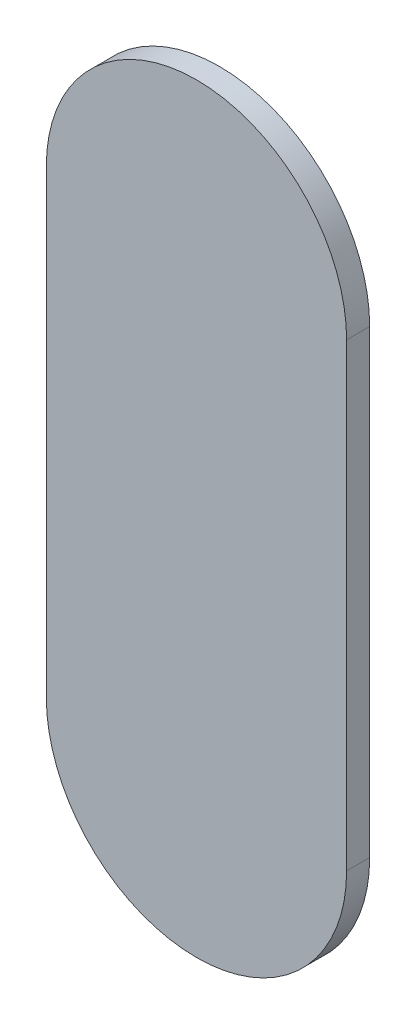
ISO-10303-21;
HEADER;
FILE_DESCRIPTION(('STEP AP214'),'2;1');
FILE_NAME('part.step','',(''),(''),'','','');
FILE_SCHEMA(('AUTOMOTIVE_DESIGN { 1 0 10303 214 1 1 1 1 }'));
ENDSEC;
DATA;
#1=APPLICATION_CONTEXT('core data for automotive mechanical design processes');
#2=APPLICATION_PROTOCOL_DEFINITION('international standard','automotive_design',2000,#1);
#3=PRODUCT_CONTEXT('',#1,'mechanical');
#4=PRODUCT('Part','Part','',(#3));
#5=PRODUCT_RELATED_PRODUCT_CATEGORY('part','',(#4));
#6=PRODUCT_DEFINITION_FORMATION('','',#4);
#7=PRODUCT_DEFINITION_CONTEXT('part definition',#1,'design');
#8=PRODUCT_DEFINITION('design','',#6,#7);
#9=PRODUCT_DEFINITION_SHAPE('','',#8);
#10=(LENGTH_UNIT() NAMED_UNIT(*) SI_UNIT(.MILLI.,.METRE.));
#11=(NAMED_UNIT(*) PLANE_ANGLE_UNIT() SI_UNIT($,.RADIAN.));
#12=(NAMED_UNIT(*) SI_UNIT($,.STERADIAN.) SOLID_ANGLE_UNIT());
#13=UNCERTAINTY_MEASURE_WITH_UNIT(LENGTH_MEASURE(1.E-05),#10,'distance_accuracy_value','');
#14=(GEOMETRIC_REPRESENTATION_CONTEXT(3) GLOBAL_UNCERTAINTY_ASSIGNED_CONTEXT((#13)) GLOBAL_UNIT_ASSIGNED_CONTEXT((#10,
#11,#12)) REPRESENTATION_CONTEXT('',''));
#15=CARTESIAN_POINT('',(0.,0.,0.));
#16=DIRECTION('',(0.,0.,1.));
#17=DIRECTION('',(1.,0.,0.));
#18=AXIS2_PLACEMENT_3D('',#15,#16,#17);
#19=CARTESIAN_POINT('',(-34.0064709631949,11.0625310612472,0.5));
#20=DIRECTION('',(0.,0.,-1.));
#21=DIRECTION('',(-1.,0.,0.));
#22=AXIS2_PLACEMENT_3D('',#19,#20,#21);
#23=CYLINDRICAL_SURFACE('',#22,3.25587240874137);
#24=CARTESIAN_POINT('',(-34.0064709631949,11.0625310612472,0.));
#25=DIRECTION('',(0.,0.,1.));
#26=DIRECTION('',(1.,0.,0.));
#27=AXIS2_PLACEMENT_3D('',#24,#25,#26);
#28=CIRCLE('',#27,3.25587240874137);
#29=CARTESIAN_POINT('',(-37.2623433719362,11.0625310612472,0.));
#30=VERTEX_POINT('',#29);
#31=CARTESIAN_POINT('',(-30.7505985544535,11.0625310612472,0.));
#32=VERTEX_POINT('',#31);
#33=EDGE_CURVE('E99',#30,#32,#28,.T.);
#34=ORIENTED_EDGE('',*,*,#33,.T.);
#35=DIRECTION('',(0.,0.,-1.));
#36=VECTOR('',#35,1.);
#37=CARTESIAN_POINT('',(-30.7505985544535,11.0625310612472,0.5));
#38=LINE('',#37,#36);
#39=CARTESIAN_POINT('',(-30.7505985544535,11.0625310612472,0.5));
#40=VERTEX_POINT('',#39);
#41=EDGE_CURVE('E11',#40,#32,#38,.T.);
#42=ORIENTED_EDGE('',*,*,#41,.F.);
#43=CARTESIAN_POINT('',(-34.0064709631949,11.0625310612472,0.5));
#44=DIRECTION('',(0.,0.,1.));
#45=DIRECTION('',(1.,0.,0.));
#46=AXIS2_PLACEMENT_3D('',#43,#44,#45);
#47=CIRCLE('',#46,3.25587240874137);
#48=CARTESIAN_POINT('',(-37.2623433719362,11.0625310612472,0.5));
#49=VERTEX_POINT('',#48);
#50=EDGE_CURVE('E87',#49,#40,#47,.T.);
#51=ORIENTED_EDGE('',*,*,#50,.F.);
#52=DIRECTION('',(0.,0.,-1.));
#53=VECTOR('',#52,1.);
#54=CARTESIAN_POINT('',(-37.2623433719362,11.0625310612472,0.5));
#55=LINE('',#54,#53);
#56=EDGE_CURVE('E95',#49,#30,#55,.T.);
#57=ORIENTED_EDGE('',*,*,#56,.T.);
#58=EDGE_LOOP('',(#34,#42,#51,#57));
#59=FACE_BOUND('',#58,.T.);
#60=ADVANCED_FACE('F36',(#59),#23,.T.);
#61=CARTESIAN_POINT('',(-30.7505985544535,11.0625310612472,0.5));
#62=DIRECTION('',(-1.,0.,0.));
#63=DIRECTION('',(0.,-1.,0.));
#64=AXIS2_PLACEMENT_3D('',#61,#62,#63);
#65=PLANE('',#64);
#66=DIRECTION('',(0.,1.,0.));
#67=VECTOR('',#66,1.);
#68=CARTESIAN_POINT('',(-30.7505985544535,11.0625310612472,0.));
#69=LINE('',#68,#67);
#70=CARTESIAN_POINT('',(-30.7505985544535,21.0334640051389,0.));
#71=VERTEX_POINT('',#70);
#72=EDGE_CURVE('E91',#32,#71,#69,.T.);
#73=ORIENTED_EDGE('',*,*,#72,.T.);
#74=DIRECTION('',(0.,0.,-1.));
#75=VECTOR('',#74,1.);
#76=CARTESIAN_POINT('',(-30.7505985544535,21.0334640051389,0.5));
#77=LINE('',#76,#75);
#78=CARTESIAN_POINT('',(-30.7505985544535,21.0334640051389,0.5));
#79=VERTEX_POINT('',#78);
#80=EDGE_CURVE('E44',#79,#71,#77,.T.);
#81=ORIENTED_EDGE('',*,*,#80,.F.);
#82=DIRECTION('',(0.,1.,0.));
#83=VECTOR('',#82,1.);
#84=CARTESIAN_POINT('',(-30.7505985544535,11.0625310612472,0.5));
#85=LINE('',#84,#83);
#86=EDGE_CURVE('E82',#40,#79,#85,.T.);
#87=ORIENTED_EDGE('',*,*,#86,.F.);
#88=ORIENTED_EDGE('',*,*,#41,.T.);
#89=EDGE_LOOP('',(#73,#81,#87,#88));
#90=FACE_BOUND('',#89,.T.);
#91=ADVANCED_FACE('F90',(#90),#65,.F.);
#92=CARTESIAN_POINT('',(-34.0064709631949,21.0334640051389,0.5));
#93=DIRECTION('',(0.,0.,-1.));
#94=DIRECTION('',(-1.,0.,0.));
#95=AXIS2_PLACEMENT_3D('',#92,#93,#94);
#96=CYLINDRICAL_SURFACE('',#95,3.25587240874137);
#97=CARTESIAN_POINT('',(-34.0064709631949,21.0334640051389,0.));
#98=DIRECTION('',(0.,0.,1.));
#99=DIRECTION('',(1.,0.,0.));
#100=AXIS2_PLACEMENT_3D('',#97,#98,#99);
#101=CIRCLE('',#100,3.25587240874137);
#102=CARTESIAN_POINT('',(-37.2623433719362,21.0334640051389,0.));
#103=VERTEX_POINT('',#102);
#104=EDGE_CURVE('E69',#71,#103,#101,.T.);
#105=ORIENTED_EDGE('',*,*,#104,.T.);
#106=DIRECTION('',(0.,0.,-1.));
#107=VECTOR('',#106,1.);
#108=CARTESIAN_POINT('',(-37.2623433719362,21.0334640051389,0.5));
#109=LINE('',#108,#107);
#110=CARTESIAN_POINT('',(-37.2623433719362,21.0334640051389,0.5));
#111=VERTEX_POINT('',#110);
#112=EDGE_CURVE('E92',#111,#103,#109,.T.);
#113=ORIENTED_EDGE('',*,*,#112,.F.);
#114=CARTESIAN_POINT('',(-34.0064709631949,21.0334640051389,0.5));
#115=DIRECTION('',(0.,0.,1.));
#116=DIRECTION('',(1.,0.,0.));
#117=AXIS2_PLACEMENT_3D('',#114,#115,#116);
#118=CIRCLE('',#117,3.25587240874137);
#119=EDGE_CURVE('E85',#79,#111,#118,.T.);
#120=ORIENTED_EDGE('',*,*,#119,.F.);
#121=ORIENTED_EDGE('',*,*,#80,.T.);
#122=EDGE_LOOP('',(#105,#113,#120,#121));
#123=FACE_BOUND('',#122,.T.);
#124=ADVANCED_FACE('F93',(#123),#96,.T.);
#125=CARTESIAN_POINT('',(-37.2623433719362,11.0625310612472,0.5));
#126=DIRECTION('',(1.,0.,0.));
#127=DIRECTION('',(0.,0.,-1.));
#128=AXIS2_PLACEMENT_3D('',#125,#126,#127);
#129=PLANE('',#128);
#130=DIRECTION('',(0.,-1.,0.));
#131=VECTOR('',#130,1.);
#132=CARTESIAN_POINT('',(-37.2623433719362,11.0625310612472,0.));
#133=LINE('',#132,#131);
#134=EDGE_CURVE('E75',#103,#30,#133,.T.);
#135=ORIENTED_EDGE('',*,*,#134,.T.);
#136=ORIENTED_EDGE('',*,*,#56,.F.);
#137=DIRECTION('',(0.,-1.,0.));
#138=VECTOR('',#137,1.);
#139=CARTESIAN_POINT('',(-37.2623433719362,11.0625310612472,0.5));
#140=LINE('',#139,#138);
#141=EDGE_CURVE('E52',#111,#49,#140,.T.);
#142=ORIENTED_EDGE('',*,*,#141,.F.);
#143=ORIENTED_EDGE('',*,*,#112,.T.);
#144=EDGE_LOOP('',(#135,#136,#142,#143));
#145=FACE_BOUND('',#144,.T.);
#146=ADVANCED_FACE('F106',(#145),#129,.F.);
#147=CARTESIAN_POINT('',(-34.0064709631949,11.0625310612472,0.5));
#148=DIRECTION('',(0.,0.,1.));
#149=DIRECTION('',(1.,0.,0.));
#150=AXIS2_PLACEMENT_3D('',#147,#148,#149);
#151=PLANE('',#150);
#152=ORIENTED_EDGE('',*,*,#50,.T.);
#153=ORIENTED_EDGE('',*,*,#86,.T.);
#154=ORIENTED_EDGE('',*,*,#119,.T.);
#155=ORIENTED_EDGE('',*,*,#141,.T.);
#156=EDGE_LOOP('',(#152,#153,#154,#155));
#157=FACE_BOUND('',#156,.T.);
#158=ADVANCED_FACE('F83',(#157),#151,.T.);
#159=CARTESIAN_POINT('',(-34.0064709631949,11.0625310612472,0.));
#160=DIRECTION('',(0.,0.,1.));
#161=DIRECTION('',(1.,0.,0.));
#162=AXIS2_PLACEMENT_3D('',#159,#160,#161);
#163=PLANE('',#162);
#164=ORIENTED_EDGE('',*,*,#33,.F.);
#165=ORIENTED_EDGE('',*,*,#134,.F.);
#166=ORIENTED_EDGE('',*,*,#104,.F.);
#167=ORIENTED_EDGE('',*,*,#72,.F.);
#168=EDGE_LOOP('',(#164,#165,#166,#167));
#169=FACE_BOUND('',#168,.T.);
#170=ADVANCED_FACE('F109',(#169),#163,.F.);
#171=CLOSED_SHELL('',(#60,#91,#124,#146,#158,#170));
#172=MANIFOLD_SOLID_BREP('B2',#171);
#173=ADVANCED_BREP_SHAPE_REPRESENTATION('',(#18,#172),#14);
#174=SHAPE_DEFINITION_REPRESENTATION(#9,#173);
ENDSEC;
END-ISO-10303-21;
